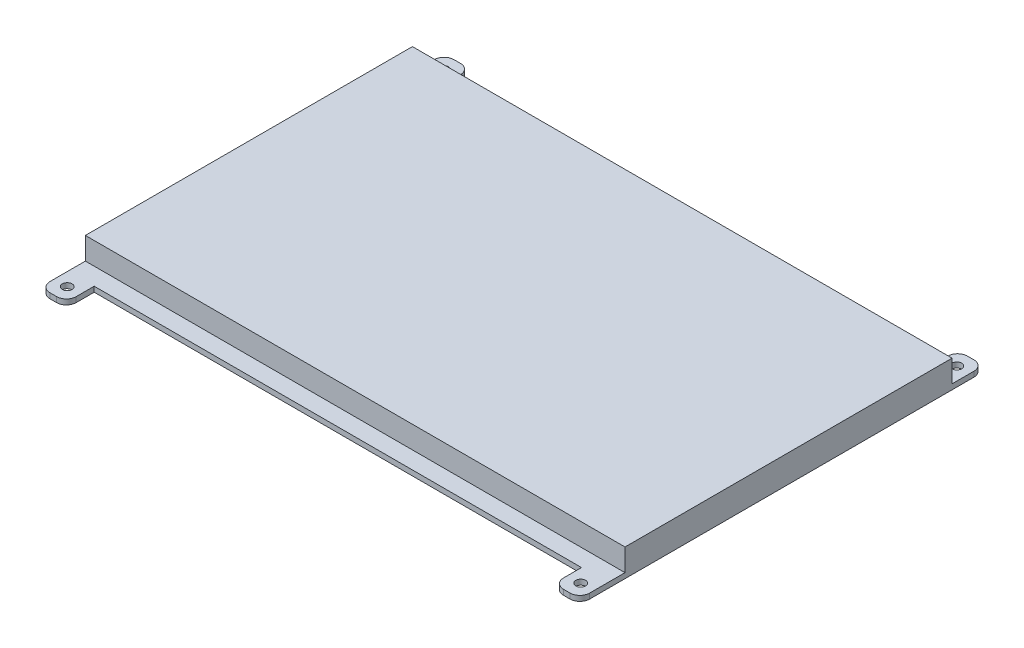
ISO-10303-21;
HEADER;
FILE_DESCRIPTION(('STEP AP214'),'2;1');
FILE_NAME('part.step','',(''),(''),'','','');
FILE_SCHEMA(('AUTOMOTIVE_DESIGN { 1 0 10303 214 1 1 1 1 }'));
ENDSEC;
DATA;
#1=APPLICATION_CONTEXT('core data for automotive mechanical design processes');
#2=APPLICATION_PROTOCOL_DEFINITION('international standard','automotive_design',2000,#1);
#3=PRODUCT_CONTEXT('',#1,'mechanical');
#4=PRODUCT('Part','Part','',(#3));
#5=PRODUCT_RELATED_PRODUCT_CATEGORY('part','',(#4));
#6=PRODUCT_DEFINITION_FORMATION('','',#4);
#7=PRODUCT_DEFINITION_CONTEXT('part definition',#1,'design');
#8=PRODUCT_DEFINITION('design','',#6,#7);
#9=PRODUCT_DEFINITION_SHAPE('','',#8);
#10=(LENGTH_UNIT() NAMED_UNIT(*) SI_UNIT(.MILLI.,.METRE.));
#11=(NAMED_UNIT(*) PLANE_ANGLE_UNIT() SI_UNIT($,.RADIAN.));
#12=(NAMED_UNIT(*) SI_UNIT($,.STERADIAN.) SOLID_ANGLE_UNIT());
#13=UNCERTAINTY_MEASURE_WITH_UNIT(LENGTH_MEASURE(1.E-05),#10,'distance_accuracy_value','');
#14=(GEOMETRIC_REPRESENTATION_CONTEXT(3) GLOBAL_UNCERTAINTY_ASSIGNED_CONTEXT((#13)) GLOBAL_UNIT_ASSIGNED_CONTEXT((#10,
#11,#12)) REPRESENTATION_CONTEXT('',''));
#15=CARTESIAN_POINT('',(0.,0.,0.));
#16=DIRECTION('',(0.,0.,1.));
#17=DIRECTION('',(1.,0.,0.));
#18=AXIS2_PLACEMENT_3D('',#15,#16,#17);
#19=CARTESIAN_POINT('',(79.5,1.6,-58.75));
#20=DIRECTION('',(0.,1.,0.));
#21=DIRECTION('',(0.,0.,1.));
#22=AXIS2_PLACEMENT_3D('',#19,#20,#21);
#23=PLANE('',#22);
#24=DIRECTION('',(-1.,0.,0.));
#25=VECTOR('',#24,1.);
#26=CARTESIAN_POINT('',(-82.5,1.6,-52.05));
#27=LINE('',#26,#25);
#28=CARTESIAN_POINT('',(82.5,1.6,-52.05));
#29=VERTEX_POINT('',#28);
#30=CARTESIAN_POINT('',(-82.5,1.6,-52.05));
#31=VERTEX_POINT('',#30);
#32=EDGE_CURVE('E53',#29,#31,#27,.T.);
#33=ORIENTED_EDGE('',*,*,#32,.F.);
#34=DIRECTION('',(0.,0.,-1.));
#35=VECTOR('',#34,1.);
#36=CARTESIAN_POINT('',(82.5,1.6,58.75));
#37=LINE('',#36,#35);
#38=CARTESIAN_POINT('',(82.5,1.6,-58.75));
#39=VERTEX_POINT('',#38);
#40=EDGE_CURVE('E335',#29,#39,#37,.T.);
#41=ORIENTED_EDGE('',*,*,#40,.T.);
#42=CARTESIAN_POINT('',(79.5,1.6,-58.75));
#43=DIRECTION('',(0.,1.,0.));
#44=DIRECTION('',(0.,0.,1.));
#45=AXIS2_PLACEMENT_3D('',#42,#43,#44);
#46=CIRCLE('',#45,3.);
#47=CARTESIAN_POINT('',(79.5,1.6,-61.75));
#48=VERTEX_POINT('',#47);
#49=EDGE_CURVE('E285',#39,#48,#46,.T.);
#50=ORIENTED_EDGE('',*,*,#49,.T.);
#51=DIRECTION('',(-1.,0.,0.));
#52=VECTOR('',#51,1.);
#53=CARTESIAN_POINT('',(79.5,1.6,-61.75));
#54=LINE('',#53,#52);
#55=CARTESIAN_POINT('',(77.5,1.6,-61.75));
#56=VERTEX_POINT('',#55);
#57=EDGE_CURVE('E288',#48,#56,#54,.T.);
#58=ORIENTED_EDGE('',*,*,#57,.T.);
#59=CARTESIAN_POINT('',(77.5,1.6,-58.75));
#60=DIRECTION('',(0.,1.,0.));
#61=DIRECTION('',(0.,0.,1.));
#62=AXIS2_PLACEMENT_3D('',#59,#60,#61);
#63=CIRCLE('',#62,3.);
#64=CARTESIAN_POINT('',(74.5,1.6,-58.75));
#65=VERTEX_POINT('',#64);
#66=EDGE_CURVE('E291',#56,#65,#63,.T.);
#67=ORIENTED_EDGE('',*,*,#66,.T.);
#68=DIRECTION('',(0.,0.,1.));
#69=VECTOR('',#68,1.);
#70=CARTESIAN_POINT('',(74.5,1.6,-58.75));
#71=LINE('',#70,#69);
#72=CARTESIAN_POINT('',(74.5,1.6,-53.25));
#73=VERTEX_POINT('',#72);
#74=EDGE_CURVE('E293',#65,#73,#71,.T.);
#75=ORIENTED_EDGE('',*,*,#74,.T.);
#76=DIRECTION('',(-1.,0.,0.));
#77=VECTOR('',#76,1.);
#78=CARTESIAN_POINT('',(74.5,1.6,-53.25));
#79=LINE('',#78,#77);
#80=CARTESIAN_POINT('',(-74.5,1.6,-53.25));
#81=VERTEX_POINT('',#80);
#82=EDGE_CURVE('E295',#73,#81,#79,.T.);
#83=ORIENTED_EDGE('',*,*,#82,.T.);
#84=DIRECTION('',(0.,0.,-1.));
#85=VECTOR('',#84,1.);
#86=CARTESIAN_POINT('',(-74.5,1.6,-58.75));
#87=LINE('',#86,#85);
#88=CARTESIAN_POINT('',(-74.5,1.6,-58.75));
#89=VERTEX_POINT('',#88);
#90=EDGE_CURVE('E298',#81,#89,#87,.T.);
#91=ORIENTED_EDGE('',*,*,#90,.T.);
#92=CARTESIAN_POINT('',(-77.5,1.6,-58.75));
#93=DIRECTION('',(0.,1.,0.));
#94=DIRECTION('',(0.,0.,-1.));
#95=AXIS2_PLACEMENT_3D('',#92,#93,#94);
#96=CIRCLE('',#95,3.);
#97=CARTESIAN_POINT('',(-77.5,1.6,-61.75));
#98=VERTEX_POINT('',#97);
#99=EDGE_CURVE('E301',#89,#98,#96,.T.);
#100=ORIENTED_EDGE('',*,*,#99,.T.);
#101=DIRECTION('',(-1.,0.,0.));
#102=VECTOR('',#101,1.);
#103=CARTESIAN_POINT('',(-79.5,1.6,-61.75));
#104=LINE('',#103,#102);
#105=CARTESIAN_POINT('',(-79.5,1.6,-61.75));
#106=VERTEX_POINT('',#105);
#107=EDGE_CURVE('E304',#98,#106,#104,.T.);
#108=ORIENTED_EDGE('',*,*,#107,.T.);
#109=CARTESIAN_POINT('',(-79.5,1.6,-58.75));
#110=DIRECTION('',(0.,1.,0.));
#111=DIRECTION('',(0.,0.,-1.));
#112=AXIS2_PLACEMENT_3D('',#109,#110,#111);
#113=CIRCLE('',#112,3.);
#114=CARTESIAN_POINT('',(-82.5,1.6,-58.75));
#115=VERTEX_POINT('',#114);
#116=EDGE_CURVE('E307',#106,#115,#113,.T.);
#117=ORIENTED_EDGE('',*,*,#116,.T.);
#118=DIRECTION('',(0.,0.,1.));
#119=VECTOR('',#118,1.);
#120=CARTESIAN_POINT('',(-82.5,1.6,58.75));
#121=LINE('',#120,#119);
#122=EDGE_CURVE('E310',#115,#31,#121,.T.);
#123=ORIENTED_EDGE('',*,*,#122,.T.);
#124=EDGE_LOOP('',(#33,#41,#50,#58,#67,#75,#83,#91,#100,#108,#117,#123));
#125=FACE_BOUND('',#124,.T.);
#126=CARTESIAN_POINT('',(-78.5,1.6,-57.5));
#127=DIRECTION('',(0.,1.,0.));
#128=DIRECTION('',(0.,0.,-1.));
#129=AXIS2_PLACEMENT_3D('',#126,#127,#128);
#130=CIRCLE('',#129,1.5);
#131=CARTESIAN_POINT('',(-78.5,1.6,-59.));
#132=VERTEX_POINT('',#131);
#133=EDGE_CURVE('E255',#132,#132,#130,.T.);
#134=ORIENTED_EDGE('',*,*,#133,.F.);
#135=EDGE_LOOP('',(#134));
#136=FACE_BOUND('',#135,.T.);
#137=CARTESIAN_POINT('',(78.5,1.6,-57.5));
#138=DIRECTION('',(0.,1.,0.));
#139=DIRECTION('',(0.,0.,1.));
#140=AXIS2_PLACEMENT_3D('',#137,#138,#139);
#141=CIRCLE('',#140,1.5);
#142=CARTESIAN_POINT('',(78.5,1.6,-56.));
#143=VERTEX_POINT('',#142);
#144=EDGE_CURVE('E279',#143,#143,#141,.T.);
#145=ORIENTED_EDGE('',*,*,#144,.F.);
#146=EDGE_LOOP('',(#145));
#147=FACE_BOUND('',#146,.T.);
#148=ADVANCED_FACE('F38',(#125,#136,#147),#23,.T.);
#149=DIRECTION('',(1.,0.,0.));
#150=VECTOR('',#149,1.);
#151=CARTESIAN_POINT('',(-82.5,1.6,47.95));
#152=LINE('',#151,#150);
#153=CARTESIAN_POINT('',(-82.5,1.6,47.95));
#154=VERTEX_POINT('',#153);
#155=CARTESIAN_POINT('',(82.5,1.6,47.95));
#156=VERTEX_POINT('',#155);
#157=EDGE_CURVE('E64',#154,#156,#152,.T.);
#158=ORIENTED_EDGE('',*,*,#157,.F.);
#159=CARTESIAN_POINT('',(-82.5,1.6,58.75));
#160=VERTEX_POINT('',#159);
#161=EDGE_CURVE('E247',#154,#160,#121,.T.);
#162=ORIENTED_EDGE('',*,*,#161,.T.);
#163=CARTESIAN_POINT('',(-79.5,1.6,58.75));
#164=DIRECTION('',(0.,1.,0.));
#165=DIRECTION('',(0.,0.,1.));
#166=AXIS2_PLACEMENT_3D('',#163,#164,#165);
#167=CIRCLE('',#166,3.);
#168=CARTESIAN_POINT('',(-79.5,1.6,61.75));
#169=VERTEX_POINT('',#168);
#170=EDGE_CURVE('E313',#160,#169,#167,.T.);
#171=ORIENTED_EDGE('',*,*,#170,.T.);
#172=DIRECTION('',(1.,0.,0.));
#173=VECTOR('',#172,1.);
#174=CARTESIAN_POINT('',(-79.5,1.6,61.75));
#175=LINE('',#174,#173);
#176=CARTESIAN_POINT('',(-77.5,1.6,61.75));
#177=VERTEX_POINT('',#176);
#178=EDGE_CURVE('E316',#169,#177,#175,.T.);
#179=ORIENTED_EDGE('',*,*,#178,.T.);
#180=CARTESIAN_POINT('',(-77.5,1.6,58.75));
#181=DIRECTION('',(0.,1.,0.));
#182=DIRECTION('',(0.,0.,1.));
#183=AXIS2_PLACEMENT_3D('',#180,#181,#182);
#184=CIRCLE('',#183,3.);
#185=CARTESIAN_POINT('',(-74.5,1.6,58.75));
#186=VERTEX_POINT('',#185);
#187=EDGE_CURVE('E319',#177,#186,#184,.T.);
#188=ORIENTED_EDGE('',*,*,#187,.T.);
#189=DIRECTION('',(0.,0.,-1.));
#190=VECTOR('',#189,1.);
#191=CARTESIAN_POINT('',(-74.5,1.6,58.75));
#192=LINE('',#191,#190);
#193=CARTESIAN_POINT('',(-74.5,1.6,53.25));
#194=VERTEX_POINT('',#193);
#195=EDGE_CURVE('E322',#186,#194,#192,.T.);
#196=ORIENTED_EDGE('',*,*,#195,.T.);
#197=DIRECTION('',(1.,0.,0.));
#198=VECTOR('',#197,1.);
#199=CARTESIAN_POINT('',(74.5,1.6,53.25));
#200=LINE('',#199,#198);
#201=CARTESIAN_POINT('',(74.5,1.6,53.25));
#202=VERTEX_POINT('',#201);
#203=EDGE_CURVE('E324',#194,#202,#200,.T.);
#204=ORIENTED_EDGE('',*,*,#203,.T.);
#205=DIRECTION('',(0.,0.,1.));
#206=VECTOR('',#205,1.);
#207=CARTESIAN_POINT('',(74.5,1.6,58.75));
#208=LINE('',#207,#206);
#209=CARTESIAN_POINT('',(74.5,1.6,58.75));
#210=VERTEX_POINT('',#209);
#211=EDGE_CURVE('E327',#202,#210,#208,.T.);
#212=ORIENTED_EDGE('',*,*,#211,.T.);
#213=CARTESIAN_POINT('',(77.5,1.6,58.75));
#214=DIRECTION('',(0.,1.,0.));
#215=DIRECTION('',(0.,0.,-1.));
#216=AXIS2_PLACEMENT_3D('',#213,#214,#215);
#217=CIRCLE('',#216,3.);
#218=CARTESIAN_POINT('',(77.5,1.6,61.75));
#219=VERTEX_POINT('',#218);
#220=EDGE_CURVE('E329',#210,#219,#217,.T.);
#221=ORIENTED_EDGE('',*,*,#220,.T.);
#222=DIRECTION('',(1.,0.,0.));
#223=VECTOR('',#222,1.);
#224=CARTESIAN_POINT('',(79.5,1.6,61.75));
#225=LINE('',#224,#223);
#226=CARTESIAN_POINT('',(79.5,1.6,61.75));
#227=VERTEX_POINT('',#226);
#228=EDGE_CURVE('E331',#219,#227,#225,.T.);
#229=ORIENTED_EDGE('',*,*,#228,.T.);
#230=CARTESIAN_POINT('',(79.5,1.6,58.75));
#231=DIRECTION('',(0.,1.,0.));
#232=DIRECTION('',(0.,0.,-1.));
#233=AXIS2_PLACEMENT_3D('',#230,#231,#232);
#234=CIRCLE('',#233,3.);
#235=CARTESIAN_POINT('',(82.5,1.6,58.75));
#236=VERTEX_POINT('',#235);
#237=EDGE_CURVE('E333',#227,#236,#234,.T.);
#238=ORIENTED_EDGE('',*,*,#237,.T.);
#239=EDGE_CURVE('E336',#236,#156,#37,.T.);
#240=ORIENTED_EDGE('',*,*,#239,.T.);
#241=EDGE_LOOP('',(#158,#162,#171,#179,#188,#196,#204,#212,#221,#229,#238,#240));
#242=FACE_BOUND('',#241,.T.);
#243=CARTESIAN_POINT('',(-78.5,1.6,57.5));
#244=DIRECTION('',(0.,1.,0.));
#245=DIRECTION('',(0.,0.,1.));
#246=AXIS2_PLACEMENT_3D('',#243,#244,#245);
#247=CIRCLE('',#246,1.5);
#248=CARTESIAN_POINT('',(-78.5,1.6,59.));
#249=VERTEX_POINT('',#248);
#250=EDGE_CURVE('E265',#249,#249,#247,.T.);
#251=ORIENTED_EDGE('',*,*,#250,.F.);
#252=EDGE_LOOP('',(#251));
#253=FACE_BOUND('',#252,.T.);
#254=CARTESIAN_POINT('',(78.5,1.6,57.5));
#255=DIRECTION('',(0.,1.,0.));
#256=DIRECTION('',(0.,0.,-1.));
#257=AXIS2_PLACEMENT_3D('',#254,#255,#256);
#258=CIRCLE('',#257,1.5);
#259=CARTESIAN_POINT('',(78.5,1.6,56.));
#260=VERTEX_POINT('',#259);
#261=EDGE_CURVE('E273',#260,#260,#258,.T.);
#262=ORIENTED_EDGE('',*,*,#261,.F.);
#263=EDGE_LOOP('',(#262));
#264=FACE_BOUND('',#263,.T.);
#265=ADVANCED_FACE('F560',(#242,#253,#264),#23,.T.);
#266=CARTESIAN_POINT('',(79.5,0.,-58.75));
#267=DIRECTION('',(0.,1.,0.));
#268=DIRECTION('',(0.,0.,1.));
#269=AXIS2_PLACEMENT_3D('',#266,#267,#268);
#270=PLANE('',#269);
#271=CARTESIAN_POINT('',(79.5,0.,-58.75));
#272=DIRECTION('',(0.,1.,0.));
#273=DIRECTION('',(0.,0.,1.));
#274=AXIS2_PLACEMENT_3D('',#271,#272,#273);
#275=CIRCLE('',#274,3.);
#276=CARTESIAN_POINT('',(82.5,0.,-58.75));
#277=VERTEX_POINT('',#276);
#278=CARTESIAN_POINT('',(79.5,0.,-61.75));
#279=VERTEX_POINT('',#278);
#280=EDGE_CURVE('E282',#277,#279,#275,.T.);
#281=ORIENTED_EDGE('',*,*,#280,.F.);
#282=DIRECTION('',(0.,0.,-1.));
#283=VECTOR('',#282,1.);
#284=CARTESIAN_POINT('',(82.5,0.,58.75));
#285=LINE('',#284,#283);
#286=CARTESIAN_POINT('',(82.5,0.,58.75));
#287=VERTEX_POINT('',#286);
#288=EDGE_CURVE('E289',#287,#277,#285,.T.);
#289=ORIENTED_EDGE('',*,*,#288,.F.);
#290=CARTESIAN_POINT('',(79.5,0.,58.75));
#291=DIRECTION('',(0.,1.,0.));
#292=DIRECTION('',(0.,0.,-1.));
#293=AXIS2_PLACEMENT_3D('',#290,#291,#292);
#294=CIRCLE('',#293,3.);
#295=CARTESIAN_POINT('',(79.5,0.,61.75));
#296=VERTEX_POINT('',#295);
#297=EDGE_CURVE('E386',#296,#287,#294,.T.);
#298=ORIENTED_EDGE('',*,*,#297,.F.);
#299=DIRECTION('',(1.,0.,0.));
#300=VECTOR('',#299,1.);
#301=CARTESIAN_POINT('',(79.5,0.,61.75));
#302=LINE('',#301,#300);
#303=CARTESIAN_POINT('',(77.5,0.,61.75));
#304=VERTEX_POINT('',#303);
#305=EDGE_CURVE('E384',#304,#296,#302,.T.);
#306=ORIENTED_EDGE('',*,*,#305,.F.);
#307=CARTESIAN_POINT('',(77.5,0.,58.75));
#308=DIRECTION('',(0.,1.,0.));
#309=DIRECTION('',(0.,0.,-1.));
#310=AXIS2_PLACEMENT_3D('',#307,#308,#309);
#311=CIRCLE('',#310,3.);
#312=CARTESIAN_POINT('',(74.5,0.,58.75));
#313=VERTEX_POINT('',#312);
#314=EDGE_CURVE('E382',#313,#304,#311,.T.);
#315=ORIENTED_EDGE('',*,*,#314,.F.);
#316=DIRECTION('',(0.,0.,1.));
#317=VECTOR('',#316,1.);
#318=CARTESIAN_POINT('',(74.5,0.,58.75));
#319=LINE('',#318,#317);
#320=CARTESIAN_POINT('',(74.5,0.,53.25));
#321=VERTEX_POINT('',#320);
#322=EDGE_CURVE('E380',#321,#313,#319,.T.);
#323=ORIENTED_EDGE('',*,*,#322,.F.);
#324=DIRECTION('',(1.,0.,0.));
#325=VECTOR('',#324,1.);
#326=CARTESIAN_POINT('',(74.5,0.,53.25));
#327=LINE('',#326,#325);
#328=CARTESIAN_POINT('',(-74.5,0.,53.25));
#329=VERTEX_POINT('',#328);
#330=EDGE_CURVE('E377',#329,#321,#327,.T.);
#331=ORIENTED_EDGE('',*,*,#330,.F.);
#332=DIRECTION('',(0.,0.,-1.));
#333=VECTOR('',#332,1.);
#334=CARTESIAN_POINT('',(-74.5,0.,58.75));
#335=LINE('',#334,#333);
#336=CARTESIAN_POINT('',(-74.5,0.,58.75));
#337=VERTEX_POINT('',#336);
#338=EDGE_CURVE('E374',#337,#329,#335,.T.);
#339=ORIENTED_EDGE('',*,*,#338,.F.);
#340=CARTESIAN_POINT('',(-77.5,0.,58.75));
#341=DIRECTION('',(0.,1.,0.));
#342=DIRECTION('',(0.,0.,1.));
#343=AXIS2_PLACEMENT_3D('',#340,#341,#342);
#344=CIRCLE('',#343,3.);
#345=CARTESIAN_POINT('',(-77.5,0.,61.75));
#346=VERTEX_POINT('',#345);
#347=EDGE_CURVE('E371',#346,#337,#344,.T.);
#348=ORIENTED_EDGE('',*,*,#347,.F.);
#349=DIRECTION('',(1.,0.,0.));
#350=VECTOR('',#349,1.);
#351=CARTESIAN_POINT('',(-79.5,0.,61.75));
#352=LINE('',#351,#350);
#353=CARTESIAN_POINT('',(-79.5,0.,61.75));
#354=VERTEX_POINT('',#353);
#355=EDGE_CURVE('E368',#354,#346,#352,.T.);
#356=ORIENTED_EDGE('',*,*,#355,.F.);
#357=CARTESIAN_POINT('',(-79.5,0.,58.75));
#358=DIRECTION('',(0.,1.,0.));
#359=DIRECTION('',(0.,0.,1.));
#360=AXIS2_PLACEMENT_3D('',#357,#358,#359);
#361=CIRCLE('',#360,3.);
#362=CARTESIAN_POINT('',(-82.5,0.,58.75));
#363=VERTEX_POINT('',#362);
#364=EDGE_CURVE('E365',#363,#354,#361,.T.);
#365=ORIENTED_EDGE('',*,*,#364,.F.);
#366=DIRECTION('',(0.,0.,1.));
#367=VECTOR('',#366,1.);
#368=CARTESIAN_POINT('',(-82.5,0.,58.75));
#369=LINE('',#368,#367);
#370=CARTESIAN_POINT('',(-82.5,0.,-58.75));
#371=VERTEX_POINT('',#370);
#372=EDGE_CURVE('E362',#371,#363,#369,.T.);
#373=ORIENTED_EDGE('',*,*,#372,.F.);
#374=CARTESIAN_POINT('',(-79.5,0.,-58.75));
#375=DIRECTION('',(0.,1.,0.));
#376=DIRECTION('',(0.,0.,-1.));
#377=AXIS2_PLACEMENT_3D('',#374,#375,#376);
#378=CIRCLE('',#377,3.);
#379=CARTESIAN_POINT('',(-79.5,0.,-61.75));
#380=VERTEX_POINT('',#379);
#381=EDGE_CURVE('E359',#380,#371,#378,.T.);
#382=ORIENTED_EDGE('',*,*,#381,.F.);
#383=DIRECTION('',(-1.,0.,0.));
#384=VECTOR('',#383,1.);
#385=CARTESIAN_POINT('',(-79.5,0.,-61.75));
#386=LINE('',#385,#384);
#387=CARTESIAN_POINT('',(-77.5,0.,-61.75));
#388=VERTEX_POINT('',#387);
#389=EDGE_CURVE('E356',#388,#380,#386,.T.);
#390=ORIENTED_EDGE('',*,*,#389,.F.);
#391=CARTESIAN_POINT('',(-77.5,0.,-58.75));
#392=DIRECTION('',(0.,1.,0.));
#393=DIRECTION('',(0.,0.,-1.));
#394=AXIS2_PLACEMENT_3D('',#391,#392,#393);
#395=CIRCLE('',#394,3.);
#396=CARTESIAN_POINT('',(-74.5,0.,-58.75));
#397=VERTEX_POINT('',#396);
#398=EDGE_CURVE('E353',#397,#388,#395,.T.);
#399=ORIENTED_EDGE('',*,*,#398,.F.);
#400=DIRECTION('',(0.,0.,-1.));
#401=VECTOR('',#400,1.);
#402=CARTESIAN_POINT('',(-74.5,0.,-58.75));
#403=LINE('',#402,#401);
#404=CARTESIAN_POINT('',(-74.5,0.,-53.25));
#405=VERTEX_POINT('',#404);
#406=EDGE_CURVE('E350',#405,#397,#403,.T.);
#407=ORIENTED_EDGE('',*,*,#406,.F.);
#408=DIRECTION('',(-1.,0.,0.));
#409=VECTOR('',#408,1.);
#410=CARTESIAN_POINT('',(74.5,0.,-53.25));
#411=LINE('',#410,#409);
#412=CARTESIAN_POINT('',(74.5,0.,-53.25));
#413=VERTEX_POINT('',#412);
#414=EDGE_CURVE('E347',#413,#405,#411,.T.);
#415=ORIENTED_EDGE('',*,*,#414,.F.);
#416=DIRECTION('',(0.,0.,1.));
#417=VECTOR('',#416,1.);
#418=CARTESIAN_POINT('',(74.5,0.,-58.75));
#419=LINE('',#418,#417);
#420=CARTESIAN_POINT('',(74.5,0.,-58.75));
#421=VERTEX_POINT('',#420);
#422=EDGE_CURVE('E345',#421,#413,#419,.T.);
#423=ORIENTED_EDGE('',*,*,#422,.F.);
#424=CARTESIAN_POINT('',(77.5,0.,-58.75));
#425=DIRECTION('',(0.,1.,0.));
#426=DIRECTION('',(0.,0.,1.));
#427=AXIS2_PLACEMENT_3D('',#424,#425,#426);
#428=CIRCLE('',#427,3.);
#429=CARTESIAN_POINT('',(77.5,0.,-61.75));
#430=VERTEX_POINT('',#429);
#431=EDGE_CURVE('E343',#430,#421,#428,.T.);
#432=ORIENTED_EDGE('',*,*,#431,.F.);
#433=DIRECTION('',(-1.,0.,0.));
#434=VECTOR('',#433,1.);
#435=CARTESIAN_POINT('',(79.5,0.,-61.75));
#436=LINE('',#435,#434);
#437=EDGE_CURVE('E341',#279,#430,#436,.T.);
#438=ORIENTED_EDGE('',*,*,#437,.F.);
#439=EDGE_LOOP('',(#281,#289,#298,#306,#315,#323,#331,#339,#348,#356,#365,#373,#382,#390,#399,
#407,#415,#423,#432,#438));
#440=FACE_BOUND('',#439,.T.);
#441=CARTESIAN_POINT('',(78.5,0.,-57.5));
#442=DIRECTION('',(0.,1.,0.));
#443=DIRECTION('',(0.,0.,1.));
#444=AXIS2_PLACEMENT_3D('',#441,#442,#443);
#445=CIRCLE('',#444,1.5);
#446=CARTESIAN_POINT('',(78.5,0.,-56.));
#447=VERTEX_POINT('',#446);
#448=EDGE_CURVE('E276',#447,#447,#445,.T.);
#449=ORIENTED_EDGE('',*,*,#448,.T.);
#450=EDGE_LOOP('',(#449));
#451=FACE_BOUND('',#450,.T.);
#452=CARTESIAN_POINT('',(78.5,0.,57.5));
#453=DIRECTION('',(0.,1.,0.));
#454=DIRECTION('',(0.,0.,-1.));
#455=AXIS2_PLACEMENT_3D('',#452,#453,#454);
#456=CIRCLE('',#455,1.5);
#457=CARTESIAN_POINT('',(78.5,0.,56.));
#458=VERTEX_POINT('',#457);
#459=EDGE_CURVE('E269',#458,#458,#456,.T.);
#460=ORIENTED_EDGE('',*,*,#459,.T.);
#461=EDGE_LOOP('',(#460));
#462=FACE_BOUND('',#461,.T.);
#463=CARTESIAN_POINT('',(-78.5,0.,57.5));
#464=DIRECTION('',(0.,1.,0.));
#465=DIRECTION('',(0.,0.,1.));
#466=AXIS2_PLACEMENT_3D('',#463,#464,#465);
#467=CIRCLE('',#466,1.5);
#468=CARTESIAN_POINT('',(-78.5,0.,59.));
#469=VERTEX_POINT('',#468);
#470=EDGE_CURVE('E263',#469,#469,#467,.T.);
#471=ORIENTED_EDGE('',*,*,#470,.T.);
#472=EDGE_LOOP('',(#471));
#473=FACE_BOUND('',#472,.T.);
#474=CARTESIAN_POINT('',(-78.5,0.,-57.5));
#475=DIRECTION('',(0.,1.,0.));
#476=DIRECTION('',(0.,0.,-1.));
#477=AXIS2_PLACEMENT_3D('',#474,#475,#476);
#478=CIRCLE('',#477,1.5);
#479=CARTESIAN_POINT('',(-78.5,0.,-59.));
#480=VERTEX_POINT('',#479);
#481=EDGE_CURVE('E249',#480,#480,#478,.T.);
#482=ORIENTED_EDGE('',*,*,#481,.T.);
#483=EDGE_LOOP('',(#482));
#484=FACE_BOUND('',#483,.T.);
#485=ADVANCED_FACE('F463',(#440,#451,#462,#473,#484),#270,.F.);
#486=CARTESIAN_POINT('',(79.5,1.6,-58.75));
#487=DIRECTION('',(0.,-1.,0.));
#488=DIRECTION('',(0.,0.,-1.));
#489=AXIS2_PLACEMENT_3D('',#486,#487,#488);
#490=CYLINDRICAL_SURFACE('',#489,3.);
#491=ORIENTED_EDGE('',*,*,#280,.T.);
#492=DIRECTION('',(0.,-1.,0.));
#493=VECTOR('',#492,1.);
#494=CARTESIAN_POINT('',(79.5,1.6,-61.75));
#495=LINE('',#494,#493);
#496=EDGE_CURVE('E11',#48,#279,#495,.T.);
#497=ORIENTED_EDGE('',*,*,#496,.F.);
#498=ORIENTED_EDGE('',*,*,#49,.F.);
#499=DIRECTION('',(0.,-1.,0.));
#500=VECTOR('',#499,1.);
#501=CARTESIAN_POINT('',(82.5,1.6,-58.75));
#502=LINE('',#501,#500);
#503=EDGE_CURVE('E338',#39,#277,#502,.T.);
#504=ORIENTED_EDGE('',*,*,#503,.T.);
#505=EDGE_LOOP('',(#491,#497,#498,#504));
#506=FACE_BOUND('',#505,.T.);
#507=ADVANCED_FACE('F40',(#506),#490,.T.);
#508=CARTESIAN_POINT('',(79.5,1.6,-61.75));
#509=DIRECTION('',(0.,0.,1.));
#510=DIRECTION('',(1.,0.,0.));
#511=AXIS2_PLACEMENT_3D('',#508,#509,#510);
#512=PLANE('',#511);
#513=ORIENTED_EDGE('',*,*,#437,.T.);
#514=DIRECTION('',(0.,-1.,0.));
#515=VECTOR('',#514,1.);
#516=CARTESIAN_POINT('',(77.5,1.6,-61.75));
#517=LINE('',#516,#515);
#518=EDGE_CURVE('E46',#56,#430,#517,.T.);
#519=ORIENTED_EDGE('',*,*,#518,.F.);
#520=ORIENTED_EDGE('',*,*,#57,.F.);
#521=ORIENTED_EDGE('',*,*,#496,.T.);
#522=EDGE_LOOP('',(#513,#519,#520,#521));
#523=FACE_BOUND('',#522,.T.);
#524=ADVANCED_FACE('F480',(#523),#512,.F.);
#525=CARTESIAN_POINT('',(77.5,1.6,-58.75));
#526=DIRECTION('',(0.,-1.,0.));
#527=DIRECTION('',(0.,0.,-1.));
#528=AXIS2_PLACEMENT_3D('',#525,#526,#527);
#529=CYLINDRICAL_SURFACE('',#528,3.);
#530=ORIENTED_EDGE('',*,*,#431,.T.);
#531=DIRECTION('',(0.,-1.,0.));
#532=VECTOR('',#531,1.);
#533=CARTESIAN_POINT('',(74.5,1.6,-58.75));
#534=LINE('',#533,#532);
#535=EDGE_CURVE('E450',#65,#421,#534,.T.);
#536=ORIENTED_EDGE('',*,*,#535,.F.);
#537=ORIENTED_EDGE('',*,*,#66,.F.);
#538=ORIENTED_EDGE('',*,*,#518,.T.);
#539=EDGE_LOOP('',(#530,#536,#537,#538));
#540=FACE_BOUND('',#539,.T.);
#541=ADVANCED_FACE('F457',(#540),#529,.T.);
#542=CARTESIAN_POINT('',(74.5,1.6,-58.75));
#543=DIRECTION('',(1.,0.,0.));
#544=DIRECTION('',(0.,0.,-1.));
#545=AXIS2_PLACEMENT_3D('',#542,#543,#544);
#546=PLANE('',#545);
#547=ORIENTED_EDGE('',*,*,#422,.T.);
#548=DIRECTION('',(0.,-1.,0.));
#549=VECTOR('',#548,1.);
#550=CARTESIAN_POINT('',(74.5,1.6,-53.25));
#551=LINE('',#550,#549);
#552=EDGE_CURVE('E447',#73,#413,#551,.T.);
#553=ORIENTED_EDGE('',*,*,#552,.F.);
#554=ORIENTED_EDGE('',*,*,#74,.F.);
#555=ORIENTED_EDGE('',*,*,#535,.T.);
#556=EDGE_LOOP('',(#547,#553,#554,#555));
#557=FACE_BOUND('',#556,.T.);
#558=ADVANCED_FACE('F469',(#557),#546,.F.);
#559=CARTESIAN_POINT('',(74.5,1.6,-53.25));
#560=DIRECTION('',(0.,0.,1.));
#561=DIRECTION('',(1.,0.,0.));
#562=AXIS2_PLACEMENT_3D('',#559,#560,#561);
#563=PLANE('',#562);
#564=ORIENTED_EDGE('',*,*,#414,.T.);
#565=DIRECTION('',(0.,-1.,0.));
#566=VECTOR('',#565,1.);
#567=CARTESIAN_POINT('',(-74.5,1.6,-53.25));
#568=LINE('',#567,#566);
#569=EDGE_CURVE('E443',#81,#405,#568,.T.);
#570=ORIENTED_EDGE('',*,*,#569,.F.);
#571=ORIENTED_EDGE('',*,*,#82,.F.);
#572=ORIENTED_EDGE('',*,*,#552,.T.);
#573=EDGE_LOOP('',(#564,#570,#571,#572));
#574=FACE_BOUND('',#573,.T.);
#575=ADVANCED_FACE('F473',(#574),#563,.F.);
#576=CARTESIAN_POINT('',(-74.5,1.6,-58.75));
#577=DIRECTION('',(-1.,0.,0.));
#578=DIRECTION('',(0.,0.,1.));
#579=AXIS2_PLACEMENT_3D('',#576,#577,#578);
#580=PLANE('',#579);
#581=ORIENTED_EDGE('',*,*,#406,.T.);
#582=DIRECTION('',(0.,-1.,0.));
#583=VECTOR('',#582,1.);
#584=CARTESIAN_POINT('',(-74.5,1.6,-58.75));
#585=LINE('',#584,#583);
#586=EDGE_CURVE('E439',#89,#397,#585,.T.);
#587=ORIENTED_EDGE('',*,*,#586,.F.);
#588=ORIENTED_EDGE('',*,*,#90,.F.);
#589=ORIENTED_EDGE('',*,*,#569,.T.);
#590=EDGE_LOOP('',(#581,#587,#588,#589));
#591=FACE_BOUND('',#590,.T.);
#592=ADVANCED_FACE('F550',(#591),#580,.F.);
#593=CARTESIAN_POINT('',(-77.5,1.6,-58.75));
#594=DIRECTION('',(0.,-1.,0.));
#595=DIRECTION('',(0.,0.,-1.));
#596=AXIS2_PLACEMENT_3D('',#593,#594,#595);
#597=CYLINDRICAL_SURFACE('',#596,3.);
#598=ORIENTED_EDGE('',*,*,#398,.T.);
#599=DIRECTION('',(0.,-1.,0.));
#600=VECTOR('',#599,1.);
#601=CARTESIAN_POINT('',(-77.5,1.6,-61.75));
#602=LINE('',#601,#600);
#603=EDGE_CURVE('E435',#98,#388,#602,.T.);
#604=ORIENTED_EDGE('',*,*,#603,.F.);
#605=ORIENTED_EDGE('',*,*,#99,.F.);
#606=ORIENTED_EDGE('',*,*,#586,.T.);
#607=EDGE_LOOP('',(#598,#604,#605,#606));
#608=FACE_BOUND('',#607,.T.);
#609=ADVANCED_FACE('F548',(#608),#597,.T.);
#610=CARTESIAN_POINT('',(-79.5,1.6,-61.75));
#611=DIRECTION('',(0.,0.,1.));
#612=DIRECTION('',(1.,0.,0.));
#613=AXIS2_PLACEMENT_3D('',#610,#611,#612);
#614=PLANE('',#613);
#615=ORIENTED_EDGE('',*,*,#389,.T.);
#616=DIRECTION('',(0.,-1.,0.));
#617=VECTOR('',#616,1.);
#618=CARTESIAN_POINT('',(-79.5,1.6,-61.75));
#619=LINE('',#618,#617);
#620=EDGE_CURVE('E431',#106,#380,#619,.T.);
#621=ORIENTED_EDGE('',*,*,#620,.F.);
#622=ORIENTED_EDGE('',*,*,#107,.F.);
#623=ORIENTED_EDGE('',*,*,#603,.T.);
#624=EDGE_LOOP('',(#615,#621,#622,#623));
#625=FACE_BOUND('',#624,.T.);
#626=ADVANCED_FACE('F543',(#625),#614,.F.);
#627=CARTESIAN_POINT('',(-79.5,1.6,-58.75));
#628=DIRECTION('',(0.,-1.,0.));
#629=DIRECTION('',(0.,0.,-1.));
#630=AXIS2_PLACEMENT_3D('',#627,#628,#629);
#631=CYLINDRICAL_SURFACE('',#630,3.);
#632=ORIENTED_EDGE('',*,*,#381,.T.);
#633=DIRECTION('',(0.,-1.,0.));
#634=VECTOR('',#633,1.);
#635=CARTESIAN_POINT('',(-82.5,1.6,-58.75));
#636=LINE('',#635,#634);
#637=EDGE_CURVE('E427',#115,#371,#636,.T.);
#638=ORIENTED_EDGE('',*,*,#637,.F.);
#639=ORIENTED_EDGE('',*,*,#116,.F.);
#640=ORIENTED_EDGE('',*,*,#620,.T.);
#641=EDGE_LOOP('',(#632,#638,#639,#640));
#642=FACE_BOUND('',#641,.T.);
#643=ADVANCED_FACE('F538',(#642),#631,.T.);
#644=CARTESIAN_POINT('',(-82.5,1.6,58.75));
#645=DIRECTION('',(1.,0.,0.));
#646=DIRECTION('',(0.,0.,-1.));
#647=AXIS2_PLACEMENT_3D('',#644,#645,#646);
#648=PLANE('',#647);
#649=ORIENTED_EDGE('',*,*,#372,.T.);
#650=DIRECTION('',(0.,-1.,0.));
#651=VECTOR('',#650,1.);
#652=CARTESIAN_POINT('',(-82.5,1.6,58.75));
#653=LINE('',#652,#651);
#654=EDGE_CURVE('E423',#160,#363,#653,.T.);
#655=ORIENTED_EDGE('',*,*,#654,.F.);
#656=ORIENTED_EDGE('',*,*,#161,.F.);
#657=DIRECTION('',(0.,-1.,0.));
#658=VECTOR('',#657,1.);
#659=CARTESIAN_POINT('',(-82.5,8.4,47.95));
#660=LINE('',#659,#658);
#661=CARTESIAN_POINT('',(-82.5,8.4,47.95));
#662=VERTEX_POINT('',#661);
#663=EDGE_CURVE('E227',#662,#154,#660,.T.);
#664=ORIENTED_EDGE('',*,*,#663,.F.);
#665=DIRECTION('',(0.,0.,1.));
#666=VECTOR('',#665,1.);
#667=CARTESIAN_POINT('',(-82.5,8.4,-52.05));
#668=LINE('',#667,#666);
#669=CARTESIAN_POINT('',(-82.5,8.4,-52.05));
#670=VERTEX_POINT('',#669);
#671=EDGE_CURVE('E234',#670,#662,#668,.T.);
#672=ORIENTED_EDGE('',*,*,#671,.F.);
#673=DIRECTION('',(0.,-1.,0.));
#674=VECTOR('',#673,1.);
#675=CARTESIAN_POINT('',(-82.5,8.4,-52.05));
#676=LINE('',#675,#674);
#677=EDGE_CURVE('E816',#670,#31,#676,.T.);
#678=ORIENTED_EDGE('',*,*,#677,.T.);
#679=ORIENTED_EDGE('',*,*,#122,.F.);
#680=ORIENTED_EDGE('',*,*,#637,.T.);
#681=EDGE_LOOP('',(#649,#655,#656,#664,#672,#678,#679,#680));
#682=FACE_BOUND('',#681,.T.);
#683=ADVANCED_FACE('F245',(#682),#648,.F.);
#684=CARTESIAN_POINT('',(-79.5,1.6,58.75));
#685=DIRECTION('',(0.,-1.,0.));
#686=DIRECTION('',(0.,0.,-1.));
#687=AXIS2_PLACEMENT_3D('',#684,#685,#686);
#688=CYLINDRICAL_SURFACE('',#687,3.);
#689=ORIENTED_EDGE('',*,*,#364,.T.);
#690=DIRECTION('',(0.,-1.,0.));
#691=VECTOR('',#690,1.);
#692=CARTESIAN_POINT('',(-79.5,1.6,61.75));
#693=LINE('',#692,#691);
#694=EDGE_CURVE('E419',#169,#354,#693,.T.);
#695=ORIENTED_EDGE('',*,*,#694,.F.);
#696=ORIENTED_EDGE('',*,*,#170,.F.);
#697=ORIENTED_EDGE('',*,*,#654,.T.);
#698=EDGE_LOOP('',(#689,#695,#696,#697));
#699=FACE_BOUND('',#698,.T.);
#700=ADVANCED_FACE('F532',(#699),#688,.T.);
#701=CARTESIAN_POINT('',(-79.5,1.6,61.75));
#702=DIRECTION('',(0.,0.,-1.));
#703=DIRECTION('',(-1.,0.,0.));
#704=AXIS2_PLACEMENT_3D('',#701,#702,#703);
#705=PLANE('',#704);
#706=ORIENTED_EDGE('',*,*,#355,.T.);
#707=DIRECTION('',(0.,-1.,0.));
#708=VECTOR('',#707,1.);
#709=CARTESIAN_POINT('',(-77.5,1.6,61.75));
#710=LINE('',#709,#708);
#711=EDGE_CURVE('E415',#177,#346,#710,.T.);
#712=ORIENTED_EDGE('',*,*,#711,.F.);
#713=ORIENTED_EDGE('',*,*,#178,.F.);
#714=ORIENTED_EDGE('',*,*,#694,.T.);
#715=EDGE_LOOP('',(#706,#712,#713,#714));
#716=FACE_BOUND('',#715,.T.);
#717=ADVANCED_FACE('F526',(#716),#705,.F.);
#718=CARTESIAN_POINT('',(-77.5,1.6,58.75));
#719=DIRECTION('',(0.,-1.,0.));
#720=DIRECTION('',(0.,0.,-1.));
#721=AXIS2_PLACEMENT_3D('',#718,#719,#720);
#722=CYLINDRICAL_SURFACE('',#721,3.);
#723=ORIENTED_EDGE('',*,*,#347,.T.);
#724=DIRECTION('',(0.,-1.,0.));
#725=VECTOR('',#724,1.);
#726=CARTESIAN_POINT('',(-74.5,1.6,58.75));
#727=LINE('',#726,#725);
#728=EDGE_CURVE('E411',#186,#337,#727,.T.);
#729=ORIENTED_EDGE('',*,*,#728,.F.);
#730=ORIENTED_EDGE('',*,*,#187,.F.);
#731=ORIENTED_EDGE('',*,*,#711,.T.);
#732=EDGE_LOOP('',(#723,#729,#730,#731));
#733=FACE_BOUND('',#732,.T.);
#734=ADVANCED_FACE('F522',(#733),#722,.T.);
#735=CARTESIAN_POINT('',(-74.5,1.6,58.75));
#736=DIRECTION('',(-1.,0.,0.));
#737=DIRECTION('',(0.,0.,1.));
#738=AXIS2_PLACEMENT_3D('',#735,#736,#737);
#739=PLANE('',#738);
#740=ORIENTED_EDGE('',*,*,#338,.T.);
#741=DIRECTION('',(0.,-1.,0.));
#742=VECTOR('',#741,1.);
#743=CARTESIAN_POINT('',(-74.5,1.6,53.25));
#744=LINE('',#743,#742);
#745=EDGE_CURVE('E407',#194,#329,#744,.T.);
#746=ORIENTED_EDGE('',*,*,#745,.F.);
#747=ORIENTED_EDGE('',*,*,#195,.F.);
#748=ORIENTED_EDGE('',*,*,#728,.T.);
#749=EDGE_LOOP('',(#740,#746,#747,#748));
#750=FACE_BOUND('',#749,.T.);
#751=ADVANCED_FACE('F517',(#750),#739,.F.);
#752=CARTESIAN_POINT('',(74.5,1.6,53.25));
#753=DIRECTION('',(0.,0.,-1.));
#754=DIRECTION('',(-1.,0.,0.));
#755=AXIS2_PLACEMENT_3D('',#752,#753,#754);
#756=PLANE('',#755);
#757=ORIENTED_EDGE('',*,*,#330,.T.);
#758=DIRECTION('',(0.,-1.,0.));
#759=VECTOR('',#758,1.);
#760=CARTESIAN_POINT('',(74.5,1.6,53.25));
#761=LINE('',#760,#759);
#762=EDGE_CURVE('E404',#202,#321,#761,.T.);
#763=ORIENTED_EDGE('',*,*,#762,.F.);
#764=ORIENTED_EDGE('',*,*,#203,.F.);
#765=ORIENTED_EDGE('',*,*,#745,.T.);
#766=EDGE_LOOP('',(#757,#763,#764,#765));
#767=FACE_BOUND('',#766,.T.);
#768=ADVANCED_FACE('F511',(#767),#756,.F.);
#769=CARTESIAN_POINT('',(74.5,1.6,58.75));
#770=DIRECTION('',(1.,0.,0.));
#771=DIRECTION('',(0.,0.,-1.));
#772=AXIS2_PLACEMENT_3D('',#769,#770,#771);
#773=PLANE('',#772);
#774=ORIENTED_EDGE('',*,*,#322,.T.);
#775=DIRECTION('',(0.,-1.,0.));
#776=VECTOR('',#775,1.);
#777=CARTESIAN_POINT('',(74.5,1.6,58.75));
#778=LINE('',#777,#776);
#779=EDGE_CURVE('E401',#210,#313,#778,.T.);
#780=ORIENTED_EDGE('',*,*,#779,.F.);
#781=ORIENTED_EDGE('',*,*,#211,.F.);
#782=ORIENTED_EDGE('',*,*,#762,.T.);
#783=EDGE_LOOP('',(#774,#780,#781,#782));
#784=FACE_BOUND('',#783,.T.);
#785=ADVANCED_FACE('F507',(#784),#773,.F.);
#786=CARTESIAN_POINT('',(77.5,1.6,58.75));
#787=DIRECTION('',(0.,-1.,0.));
#788=DIRECTION('',(0.,0.,-1.));
#789=AXIS2_PLACEMENT_3D('',#786,#787,#788);
#790=CYLINDRICAL_SURFACE('',#789,3.);
#791=ORIENTED_EDGE('',*,*,#314,.T.);
#792=DIRECTION('',(0.,-1.,0.));
#793=VECTOR('',#792,1.);
#794=CARTESIAN_POINT('',(77.5,1.6,61.75));
#795=LINE('',#794,#793);
#796=EDGE_CURVE('E398',#219,#304,#795,.T.);
#797=ORIENTED_EDGE('',*,*,#796,.F.);
#798=ORIENTED_EDGE('',*,*,#220,.F.);
#799=ORIENTED_EDGE('',*,*,#779,.T.);
#800=EDGE_LOOP('',(#791,#797,#798,#799));
#801=FACE_BOUND('',#800,.T.);
#802=ADVANCED_FACE('F502',(#801),#790,.T.);
#803=CARTESIAN_POINT('',(79.5,1.6,61.75));
#804=DIRECTION('',(0.,0.,-1.));
#805=DIRECTION('',(-1.,0.,0.));
#806=AXIS2_PLACEMENT_3D('',#803,#804,#805);
#807=PLANE('',#806);
#808=ORIENTED_EDGE('',*,*,#305,.T.);
#809=DIRECTION('',(0.,-1.,0.));
#810=VECTOR('',#809,1.);
#811=CARTESIAN_POINT('',(79.5,1.6,61.75));
#812=LINE('',#811,#810);
#813=EDGE_CURVE('E395',#227,#296,#812,.T.);
#814=ORIENTED_EDGE('',*,*,#813,.F.);
#815=ORIENTED_EDGE('',*,*,#228,.F.);
#816=ORIENTED_EDGE('',*,*,#796,.T.);
#817=EDGE_LOOP('',(#808,#814,#815,#816));
#818=FACE_BOUND('',#817,.T.);
#819=ADVANCED_FACE('F496',(#818),#807,.F.);
#820=CARTESIAN_POINT('',(79.5,1.6,58.75));
#821=DIRECTION('',(0.,-1.,0.));
#822=DIRECTION('',(0.,0.,-1.));
#823=AXIS2_PLACEMENT_3D('',#820,#821,#822);
#824=CYLINDRICAL_SURFACE('',#823,3.);
#825=ORIENTED_EDGE('',*,*,#297,.T.);
#826=DIRECTION('',(0.,-1.,0.));
#827=VECTOR('',#826,1.);
#828=CARTESIAN_POINT('',(82.5,1.6,58.75));
#829=LINE('',#828,#827);
#830=EDGE_CURVE('E392',#236,#287,#829,.T.);
#831=ORIENTED_EDGE('',*,*,#830,.F.);
#832=ORIENTED_EDGE('',*,*,#237,.F.);
#833=ORIENTED_EDGE('',*,*,#813,.T.);
#834=EDGE_LOOP('',(#825,#831,#832,#833));
#835=FACE_BOUND('',#834,.T.);
#836=ADVANCED_FACE('F492',(#835),#824,.T.);
#837=CARTESIAN_POINT('',(82.5,1.6,58.75));
#838=DIRECTION('',(-1.,0.,0.));
#839=DIRECTION('',(0.,0.,1.));
#840=AXIS2_PLACEMENT_3D('',#837,#838,#839);
#841=PLANE('',#840);
#842=ORIENTED_EDGE('',*,*,#288,.T.);
#843=ORIENTED_EDGE('',*,*,#503,.F.);
#844=ORIENTED_EDGE('',*,*,#40,.F.);
#845=DIRECTION('',(0.,-1.,0.));
#846=VECTOR('',#845,1.);
#847=CARTESIAN_POINT('',(82.5,8.4,-52.05));
#848=LINE('',#847,#846);
#849=CARTESIAN_POINT('',(82.5,8.4,-52.05));
#850=VERTEX_POINT('',#849);
#851=EDGE_CURVE('E257',#850,#29,#848,.T.);
#852=ORIENTED_EDGE('',*,*,#851,.F.);
#853=DIRECTION('',(0.,0.,-1.));
#854=VECTOR('',#853,1.);
#855=CARTESIAN_POINT('',(82.5,8.4,-52.05));
#856=LINE('',#855,#854);
#857=CARTESIAN_POINT('',(82.5,8.4,47.95));
#858=VERTEX_POINT('',#857);
#859=EDGE_CURVE('E233',#858,#850,#856,.T.);
#860=ORIENTED_EDGE('',*,*,#859,.F.);
#861=DIRECTION('',(0.,-1.,0.));
#862=VECTOR('',#861,1.);
#863=CARTESIAN_POINT('',(82.5,8.4,47.95));
#864=LINE('',#863,#862);
#865=EDGE_CURVE('E229',#858,#156,#864,.T.);
#866=ORIENTED_EDGE('',*,*,#865,.T.);
#867=ORIENTED_EDGE('',*,*,#239,.F.);
#868=ORIENTED_EDGE('',*,*,#830,.T.);
#869=EDGE_LOOP('',(#842,#843,#844,#852,#860,#866,#867,#868));
#870=FACE_BOUND('',#869,.T.);
#871=ADVANCED_FACE('F487',(#870),#841,.F.);
#872=CARTESIAN_POINT('',(78.5,1.6,-57.5));
#873=DIRECTION('',(0.,-1.,0.));
#874=DIRECTION('',(0.,0.,-1.));
#875=AXIS2_PLACEMENT_3D('',#872,#873,#874);
#876=CYLINDRICAL_SURFACE('',#875,1.5);
#877=ORIENTED_EDGE('',*,*,#144,.T.);
#878=EDGE_LOOP('',(#877));
#879=FACE_BOUND('',#878,.T.);
#880=ORIENTED_EDGE('',*,*,#448,.F.);
#881=EDGE_LOOP('',(#880));
#882=FACE_BOUND('',#881,.T.);
#883=ADVANCED_FACE('F567',(#879,#882),#876,.F.);
#884=CARTESIAN_POINT('',(78.5,1.6,57.5));
#885=DIRECTION('',(0.,-1.,0.));
#886=DIRECTION('',(0.,0.,-1.));
#887=AXIS2_PLACEMENT_3D('',#884,#885,#886);
#888=CYLINDRICAL_SURFACE('',#887,1.5);
#889=ORIENTED_EDGE('',*,*,#261,.T.);
#890=EDGE_LOOP('',(#889));
#891=FACE_BOUND('',#890,.T.);
#892=ORIENTED_EDGE('',*,*,#459,.F.);
#893=EDGE_LOOP('',(#892));
#894=FACE_BOUND('',#893,.T.);
#895=ADVANCED_FACE('F654',(#891,#894),#888,.F.);
#896=CARTESIAN_POINT('',(-78.5,1.6,57.5));
#897=DIRECTION('',(0.,-1.,0.));
#898=DIRECTION('',(0.,0.,-1.));
#899=AXIS2_PLACEMENT_3D('',#896,#897,#898);
#900=CYLINDRICAL_SURFACE('',#899,1.5);
#901=ORIENTED_EDGE('',*,*,#250,.T.);
#902=EDGE_LOOP('',(#901));
#903=FACE_BOUND('',#902,.T.);
#904=ORIENTED_EDGE('',*,*,#470,.F.);
#905=EDGE_LOOP('',(#904));
#906=FACE_BOUND('',#905,.T.);
#907=ADVANCED_FACE('F661',(#903,#906),#900,.F.);
#908=CARTESIAN_POINT('',(-78.5,1.6,-57.5));
#909=DIRECTION('',(0.,-1.,0.));
#910=DIRECTION('',(0.,0.,-1.));
#911=AXIS2_PLACEMENT_3D('',#908,#909,#910);
#912=CYLINDRICAL_SURFACE('',#911,1.5);
#913=ORIENTED_EDGE('',*,*,#133,.T.);
#914=EDGE_LOOP('',(#913));
#915=FACE_BOUND('',#914,.T.);
#916=ORIENTED_EDGE('',*,*,#481,.F.);
#917=EDGE_LOOP('',(#916));
#918=FACE_BOUND('',#917,.T.);
#919=ADVANCED_FACE('F668',(#915,#918),#912,.F.);
#920=CARTESIAN_POINT('',(-82.5,8.4,47.95));
#921=DIRECTION('',(0.,0.,-1.));
#922=DIRECTION('',(-1.,0.,0.));
#923=AXIS2_PLACEMENT_3D('',#920,#921,#922);
#924=PLANE('',#923);
#925=ORIENTED_EDGE('',*,*,#157,.T.);
#926=ORIENTED_EDGE('',*,*,#865,.F.);
#927=DIRECTION('',(1.,0.,0.));
#928=VECTOR('',#927,1.);
#929=CARTESIAN_POINT('',(-82.5,8.4,47.95));
#930=LINE('',#929,#928);
#931=EDGE_CURVE('E223',#662,#858,#930,.T.);
#932=ORIENTED_EDGE('',*,*,#931,.F.);
#933=ORIENTED_EDGE('',*,*,#663,.T.);
#934=EDGE_LOOP('',(#925,#926,#932,#933));
#935=FACE_BOUND('',#934,.T.);
#936=ADVANCED_FACE('F225',(#935),#924,.F.);
#937=CARTESIAN_POINT('',(-82.5,8.4,-52.05));
#938=DIRECTION('',(0.,0.,1.));
#939=DIRECTION('',(1.,0.,0.));
#940=AXIS2_PLACEMENT_3D('',#937,#938,#939);
#941=PLANE('',#940);
#942=ORIENTED_EDGE('',*,*,#32,.T.);
#943=ORIENTED_EDGE('',*,*,#677,.F.);
#944=DIRECTION('',(-1.,0.,0.));
#945=VECTOR('',#944,1.);
#946=CARTESIAN_POINT('',(-82.5,8.4,-52.05));
#947=LINE('',#946,#945);
#948=EDGE_CURVE('E239',#850,#670,#947,.T.);
#949=ORIENTED_EDGE('',*,*,#948,.F.);
#950=ORIENTED_EDGE('',*,*,#851,.T.);
#951=EDGE_LOOP('',(#942,#943,#949,#950));
#952=FACE_BOUND('',#951,.T.);
#953=ADVANCED_FACE('F684',(#952),#941,.F.);
#954=CARTESIAN_POINT('',(0.,8.4,0.));
#955=DIRECTION('',(0.,1.,0.));
#956=DIRECTION('',(0.,0.,1.));
#957=AXIS2_PLACEMENT_3D('',#954,#955,#956);
#958=PLANE('',#957);
#959=ORIENTED_EDGE('',*,*,#671,.T.);
#960=ORIENTED_EDGE('',*,*,#931,.T.);
#961=ORIENTED_EDGE('',*,*,#859,.T.);
#962=ORIENTED_EDGE('',*,*,#948,.T.);
#963=EDGE_LOOP('',(#959,#960,#961,#962));
#964=FACE_BOUND('',#963,.T.);
#965=ADVANCED_FACE('F237',(#964),#958,.T.);
#966=CLOSED_SHELL('',(#148,#265,#485,#507,#524,#541,#558,#575,#592,#609,#626,#643,#683,#700,
#717,#734,#751,#768,#785,#802,#819,#836,#871,#883,#895,#907,#919,#936,#953,#965));
#967=MANIFOLD_SOLID_BREP('B2',#966);
#968=ADVANCED_BREP_SHAPE_REPRESENTATION('',(#18,#967),#14);
#969=SHAPE_DEFINITION_REPRESENTATION(#9,#968);
ENDSEC;
END-ISO-10303-21;
